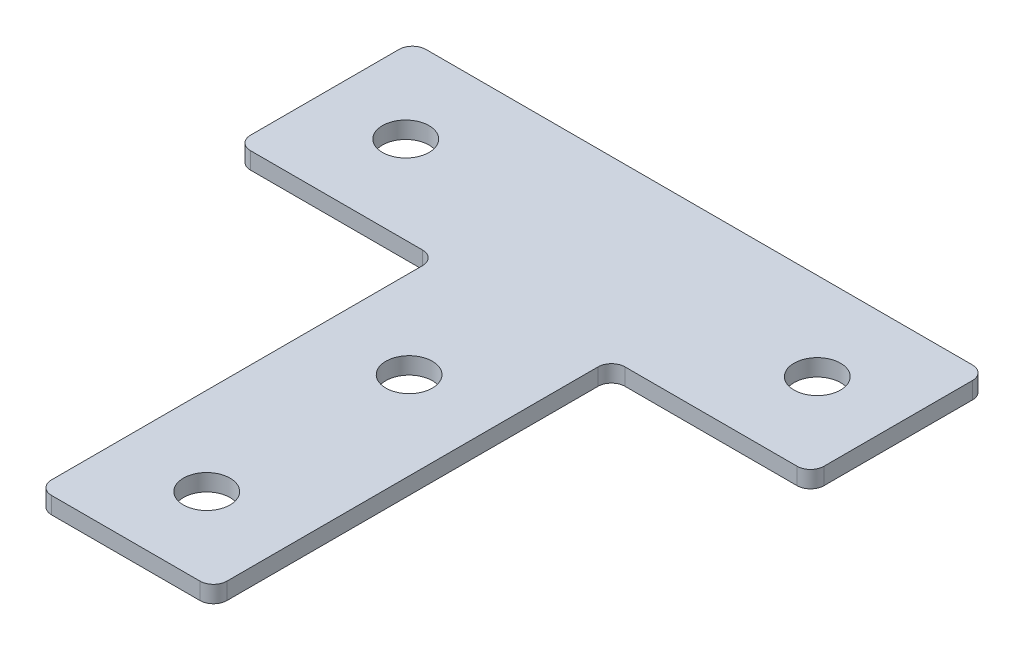
ISO-10303-21;
HEADER;
FILE_DESCRIPTION(('STEP AP214'),'2;1');
FILE_NAME('part.step','',(''),(''),'','','');
FILE_SCHEMA(('AUTOMOTIVE_DESIGN { 1 0 10303 214 1 1 1 1 }'));
ENDSEC;
DATA;
#1=APPLICATION_CONTEXT('core data for automotive mechanical design processes');
#2=APPLICATION_PROTOCOL_DEFINITION('international standard','automotive_design',2000,#1);
#3=PRODUCT_CONTEXT('',#1,'mechanical');
#4=PRODUCT('Part','Part','',(#3));
#5=PRODUCT_RELATED_PRODUCT_CATEGORY('part','',(#4));
#6=PRODUCT_DEFINITION_FORMATION('','',#4);
#7=PRODUCT_DEFINITION_CONTEXT('part definition',#1,'design');
#8=PRODUCT_DEFINITION('design','',#6,#7);
#9=PRODUCT_DEFINITION_SHAPE('','',#8);
#10=(LENGTH_UNIT() NAMED_UNIT(*) SI_UNIT(.MILLI.,.METRE.));
#11=(NAMED_UNIT(*) PLANE_ANGLE_UNIT() SI_UNIT($,.RADIAN.));
#12=(NAMED_UNIT(*) SI_UNIT($,.STERADIAN.) SOLID_ANGLE_UNIT());
#13=UNCERTAINTY_MEASURE_WITH_UNIT(LENGTH_MEASURE(1.E-05),#10,'distance_accuracy_value','');
#14=(GEOMETRIC_REPRESENTATION_CONTEXT(3) GLOBAL_UNCERTAINTY_ASSIGNED_CONTEXT((#13)) GLOBAL_UNIT_ASSIGNED_CONTEXT((#10,
#11,#12)) REPRESENTATION_CONTEXT('',''));
#15=CARTESIAN_POINT('',(0.,0.,0.));
#16=DIRECTION('',(0.,0.,1.));
#17=DIRECTION('',(1.,0.,0.));
#18=AXIS2_PLACEMENT_3D('',#15,#16,#17);
#19=CARTESIAN_POINT('',(0.,2.5,0.));
#20=DIRECTION('',(0.,1.,0.));
#21=DIRECTION('',(0.,0.,1.));
#22=AXIS2_PLACEMENT_3D('',#19,#20,#21);
#23=PLANE('',#22);
#24=CARTESIAN_POINT('',(-30.5,2.5,0.));
#25=DIRECTION('',(0.,1.,0.));
#26=DIRECTION('',(0.,0.,1.));
#27=AXIS2_PLACEMENT_3D('',#24,#25,#26);
#28=CIRCLE('',#27,3.45);
#29=CARTESIAN_POINT('',(-30.5,2.5,3.45));
#30=VERTEX_POINT('',#29);
#31=EDGE_CURVE('E299',#30,#30,#28,.T.);
#32=ORIENTED_EDGE('',*,*,#31,.F.);
#33=EDGE_LOOP('',(#32));
#34=FACE_BOUND('',#33,.T.);
#35=CARTESIAN_POINT('',(0.,2.5,60.));
#36=DIRECTION('',(0.,1.,0.));
#37=DIRECTION('',(0.,0.,1.));
#38=AXIS2_PLACEMENT_3D('',#35,#36,#37);
#39=CIRCLE('',#38,3.45);
#40=CARTESIAN_POINT('',(0.,2.5,63.45));
#41=VERTEX_POINT('',#40);
#42=EDGE_CURVE('E277',#41,#41,#39,.T.);
#43=ORIENTED_EDGE('',*,*,#42,.F.);
#44=EDGE_LOOP('',(#43));
#45=FACE_BOUND('',#44,.T.);
#46=DIRECTION('',(1.,0.,0.));
#47=VECTOR('',#46,1.);
#48=CARTESIAN_POINT('',(-13.,2.5,72.));
#49=LINE('',#48,#47);
#50=CARTESIAN_POINT('',(-11.,2.5,72.));
#51=VERTEX_POINT('',#50);
#52=CARTESIAN_POINT('',(11.,2.5,72.));
#53=VERTEX_POINT('',#52);
#54=EDGE_CURVE('E257',#51,#53,#49,.T.);
#55=ORIENTED_EDGE('',*,*,#54,.T.);
#56=CARTESIAN_POINT('',(11.,2.5,70.));
#57=DIRECTION('',(0.,1.,0.));
#58=DIRECTION('',(0.,0.,1.));
#59=AXIS2_PLACEMENT_3D('',#56,#57,#58);
#60=CIRCLE('',#59,2.);
#61=CARTESIAN_POINT('',(13.,2.5,70.));
#62=VERTEX_POINT('',#61);
#63=EDGE_CURVE('E205',#53,#62,#60,.T.);
#64=ORIENTED_EDGE('',*,*,#63,.T.);
#65=DIRECTION('',(0.,0.,-1.));
#66=VECTOR('',#65,1.);
#67=CARTESIAN_POINT('',(13.,2.5,72.));
#68=LINE('',#67,#66);
#69=CARTESIAN_POINT('',(13.,2.5,15.));
#70=VERTEX_POINT('',#69);
#71=EDGE_CURVE('E166',#62,#70,#68,.T.);
#72=ORIENTED_EDGE('',*,*,#71,.T.);
#73=CARTESIAN_POINT('',(15.,2.5,15.));
#74=DIRECTION('',(0.,1.,0.));
#75=DIRECTION('',(0.,0.,1.));
#76=AXIS2_PLACEMENT_3D('',#73,#74,#75);
#77=CIRCLE('',#76,2.);
#78=CARTESIAN_POINT('',(15.,2.5,13.));
#79=VERTEX_POINT('',#78);
#80=EDGE_CURVE('E11',#70,#79,#77,.F.);
#81=ORIENTED_EDGE('',*,*,#80,.T.);
#82=DIRECTION('',(1.,0.,0.));
#83=VECTOR('',#82,1.);
#84=CARTESIAN_POINT('',(13.,2.5,13.));
#85=LINE('',#84,#83);
#86=CARTESIAN_POINT('',(40.5,2.5,13.));
#87=VERTEX_POINT('',#86);
#88=EDGE_CURVE('E182',#79,#87,#85,.T.);
#89=ORIENTED_EDGE('',*,*,#88,.T.);
#90=CARTESIAN_POINT('',(40.5,2.5,11.));
#91=DIRECTION('',(0.,1.,0.));
#92=DIRECTION('',(0.,0.,1.));
#93=AXIS2_PLACEMENT_3D('',#90,#91,#92);
#94=CIRCLE('',#93,2.);
#95=CARTESIAN_POINT('',(42.5,2.5,11.));
#96=VERTEX_POINT('',#95);
#97=EDGE_CURVE('E199',#87,#96,#94,.T.);
#98=ORIENTED_EDGE('',*,*,#97,.T.);
#99=DIRECTION('',(0.,0.,-1.));
#100=VECTOR('',#99,1.);
#101=CARTESIAN_POINT('',(42.5,2.5,-13.));
#102=LINE('',#101,#100);
#103=CARTESIAN_POINT('',(42.5,2.5,-11.));
#104=VERTEX_POINT('',#103);
#105=EDGE_CURVE('E176',#96,#104,#102,.T.);
#106=ORIENTED_EDGE('',*,*,#105,.T.);
#107=CARTESIAN_POINT('',(40.5,2.5,-11.));
#108=DIRECTION('',(0.,1.,0.));
#109=DIRECTION('',(0.,0.,1.));
#110=AXIS2_PLACEMENT_3D('',#107,#108,#109);
#111=CIRCLE('',#110,2.);
#112=CARTESIAN_POINT('',(40.5,2.5,-13.));
#113=VERTEX_POINT('',#112);
#114=EDGE_CURVE('E197',#104,#113,#111,.T.);
#115=ORIENTED_EDGE('',*,*,#114,.T.);
#116=DIRECTION('',(-1.,0.,0.));
#117=VECTOR('',#116,1.);
#118=CARTESIAN_POINT('',(-42.5,2.5,-13.));
#119=LINE('',#118,#117);
#120=CARTESIAN_POINT('',(-40.5,2.5,-13.));
#121=VERTEX_POINT('',#120);
#122=EDGE_CURVE('E285',#113,#121,#119,.T.);
#123=ORIENTED_EDGE('',*,*,#122,.T.);
#124=CARTESIAN_POINT('',(-40.5,2.5,-11.));
#125=DIRECTION('',(0.,1.,0.));
#126=DIRECTION('',(0.,0.,1.));
#127=AXIS2_PLACEMENT_3D('',#124,#125,#126);
#128=CIRCLE('',#127,2.);
#129=CARTESIAN_POINT('',(-42.5,2.5,-11.));
#130=VERTEX_POINT('',#129);
#131=EDGE_CURVE('E195',#121,#130,#128,.T.);
#132=ORIENTED_EDGE('',*,*,#131,.T.);
#133=DIRECTION('',(0.,0.,1.));
#134=VECTOR('',#133,1.);
#135=CARTESIAN_POINT('',(-42.5,2.5,-13.));
#136=LINE('',#135,#134);
#137=CARTESIAN_POINT('',(-42.5,2.5,11.));
#138=VERTEX_POINT('',#137);
#139=EDGE_CURVE('E282',#130,#138,#136,.T.);
#140=ORIENTED_EDGE('',*,*,#139,.T.);
#141=CARTESIAN_POINT('',(-40.5,2.5,11.));
#142=DIRECTION('',(0.,1.,0.));
#143=DIRECTION('',(0.,0.,1.));
#144=AXIS2_PLACEMENT_3D('',#141,#142,#143);
#145=CIRCLE('',#144,2.);
#146=CARTESIAN_POINT('',(-40.5,2.5,13.));
#147=VERTEX_POINT('',#146);
#148=EDGE_CURVE('E201',#138,#147,#145,.T.);
#149=ORIENTED_EDGE('',*,*,#148,.T.);
#150=DIRECTION('',(1.,0.,0.));
#151=VECTOR('',#150,1.);
#152=CARTESIAN_POINT('',(-42.5,2.5,13.));
#153=LINE('',#152,#151);
#154=CARTESIAN_POINT('',(-15.,2.5,13.));
#155=VERTEX_POINT('',#154);
#156=EDGE_CURVE('E248',#147,#155,#153,.T.);
#157=ORIENTED_EDGE('',*,*,#156,.T.);
#158=CARTESIAN_POINT('',(-15.,2.5,15.));
#159=DIRECTION('',(0.,1.,0.));
#160=DIRECTION('',(0.,0.,1.));
#161=AXIS2_PLACEMENT_3D('',#158,#159,#160);
#162=CIRCLE('',#161,2.);
#163=CARTESIAN_POINT('',(-13.,2.5,15.));
#164=VERTEX_POINT('',#163);
#165=EDGE_CURVE('E238',#155,#164,#162,.F.);
#166=ORIENTED_EDGE('',*,*,#165,.T.);
#167=DIRECTION('',(0.,0.,1.));
#168=VECTOR('',#167,1.);
#169=CARTESIAN_POINT('',(-13.,2.5,72.));
#170=LINE('',#169,#168);
#171=CARTESIAN_POINT('',(-13.,2.5,70.));
#172=VERTEX_POINT('',#171);
#173=EDGE_CURVE('E245',#164,#172,#170,.T.);
#174=ORIENTED_EDGE('',*,*,#173,.T.);
#175=CARTESIAN_POINT('',(-11.,2.5,70.));
#176=DIRECTION('',(0.,1.,0.));
#177=DIRECTION('',(0.,0.,1.));
#178=AXIS2_PLACEMENT_3D('',#175,#176,#177);
#179=CIRCLE('',#178,2.);
#180=EDGE_CURVE('E203',#172,#51,#179,.T.);
#181=ORIENTED_EDGE('',*,*,#180,.T.);
#182=EDGE_LOOP('',(#55,#64,#72,#81,#89,#98,#106,#115,#123,#132,#140,#149,#157,#166,#174,#181));
#183=FACE_BOUND('',#182,.T.);
#184=CARTESIAN_POINT('',(0.,2.5,30.));
#185=DIRECTION('',(0.,1.,0.));
#186=DIRECTION('',(0.,0.,1.));
#187=AXIS2_PLACEMENT_3D('',#184,#185,#186);
#188=CIRCLE('',#187,3.45);
#189=CARTESIAN_POINT('',(0.,2.5,33.45));
#190=VERTEX_POINT('',#189);
#191=EDGE_CURVE('E293',#190,#190,#188,.T.);
#192=ORIENTED_EDGE('',*,*,#191,.F.);
#193=EDGE_LOOP('',(#192));
#194=FACE_BOUND('',#193,.T.);
#195=CARTESIAN_POINT('',(30.5,2.5,0.));
#196=DIRECTION('',(0.,1.,0.));
#197=DIRECTION('',(0.,0.,1.));
#198=AXIS2_PLACEMENT_3D('',#195,#196,#197);
#199=CIRCLE('',#198,3.45000000000001);
#200=CARTESIAN_POINT('',(30.5,2.5,3.45000000000001));
#201=VERTEX_POINT('',#200);
#202=EDGE_CURVE('E305',#201,#201,#199,.T.);
#203=ORIENTED_EDGE('',*,*,#202,.F.);
#204=EDGE_LOOP('',(#203));
#205=FACE_BOUND('',#204,.T.);
#206=ADVANCED_FACE('F34',(#34,#45,#183,#194,#205),#23,.T.);
#207=CARTESIAN_POINT('',(0.,0.,0.));
#208=DIRECTION('',(0.,1.,0.));
#209=DIRECTION('',(0.,0.,1.));
#210=AXIS2_PLACEMENT_3D('',#207,#208,#209);
#211=PLANE('',#210);
#212=DIRECTION('',(0.,0.,-1.));
#213=VECTOR('',#212,1.);
#214=CARTESIAN_POINT('',(13.,0.,72.));
#215=LINE('',#214,#213);
#216=CARTESIAN_POINT('',(13.,0.,70.));
#217=VERTEX_POINT('',#216);
#218=CARTESIAN_POINT('',(13.,0.,15.));
#219=VERTEX_POINT('',#218);
#220=EDGE_CURVE('E164',#217,#219,#215,.T.);
#221=ORIENTED_EDGE('',*,*,#220,.F.);
#222=CARTESIAN_POINT('',(11.,0.,70.));
#223=DIRECTION('',(0.,1.,0.));
#224=DIRECTION('',(0.,0.,1.));
#225=AXIS2_PLACEMENT_3D('',#222,#223,#224);
#226=CIRCLE('',#225,2.);
#227=CARTESIAN_POINT('',(11.,0.,72.));
#228=VERTEX_POINT('',#227);
#229=EDGE_CURVE('E147',#217,#228,#226,.F.);
#230=ORIENTED_EDGE('',*,*,#229,.T.);
#231=DIRECTION('',(1.,0.,0.));
#232=VECTOR('',#231,1.);
#233=CARTESIAN_POINT('',(-13.,0.,72.));
#234=LINE('',#233,#232);
#235=CARTESIAN_POINT('',(-11.,0.,72.));
#236=VERTEX_POINT('',#235);
#237=EDGE_CURVE('E174',#236,#228,#234,.T.);
#238=ORIENTED_EDGE('',*,*,#237,.F.);
#239=CARTESIAN_POINT('',(-11.,0.,70.));
#240=DIRECTION('',(0.,1.,0.));
#241=DIRECTION('',(0.,0.,1.));
#242=AXIS2_PLACEMENT_3D('',#239,#240,#241);
#243=CIRCLE('',#242,2.);
#244=CARTESIAN_POINT('',(-13.,0.,70.));
#245=VERTEX_POINT('',#244);
#246=EDGE_CURVE('E158',#236,#245,#243,.F.);
#247=ORIENTED_EDGE('',*,*,#246,.T.);
#248=DIRECTION('',(0.,0.,1.));
#249=VECTOR('',#248,1.);
#250=CARTESIAN_POINT('',(-13.,0.,72.));
#251=LINE('',#250,#249);
#252=CARTESIAN_POINT('',(-13.,0.,15.));
#253=VERTEX_POINT('',#252);
#254=EDGE_CURVE('E178',#253,#245,#251,.T.);
#255=ORIENTED_EDGE('',*,*,#254,.F.);
#256=CARTESIAN_POINT('',(-15.,0.,15.));
#257=DIRECTION('',(0.,1.,0.));
#258=DIRECTION('',(0.,0.,1.));
#259=AXIS2_PLACEMENT_3D('',#256,#257,#258);
#260=CIRCLE('',#259,2.);
#261=CARTESIAN_POINT('',(-15.,0.,13.));
#262=VERTEX_POINT('',#261);
#263=EDGE_CURVE('E236',#253,#262,#260,.T.);
#264=ORIENTED_EDGE('',*,*,#263,.T.);
#265=DIRECTION('',(1.,0.,0.));
#266=VECTOR('',#265,1.);
#267=CARTESIAN_POINT('',(-42.5,0.,13.));
#268=LINE('',#267,#266);
#269=CARTESIAN_POINT('',(-40.5,0.,13.));
#270=VERTEX_POINT('',#269);
#271=EDGE_CURVE('E262',#270,#262,#268,.T.);
#272=ORIENTED_EDGE('',*,*,#271,.F.);
#273=CARTESIAN_POINT('',(-40.5,0.,11.));
#274=DIRECTION('',(0.,1.,0.));
#275=DIRECTION('',(0.,0.,1.));
#276=AXIS2_PLACEMENT_3D('',#273,#274,#275);
#277=CIRCLE('',#276,2.);
#278=CARTESIAN_POINT('',(-42.5,0.,11.));
#279=VERTEX_POINT('',#278);
#280=EDGE_CURVE('E189',#270,#279,#277,.F.);
#281=ORIENTED_EDGE('',*,*,#280,.T.);
#282=DIRECTION('',(0.,0.,1.));
#283=VECTOR('',#282,1.);
#284=CARTESIAN_POINT('',(-42.5,0.,-13.));
#285=LINE('',#284,#283);
#286=CARTESIAN_POINT('',(-42.5,0.,-11.));
#287=VERTEX_POINT('',#286);
#288=EDGE_CURVE('E266',#287,#279,#285,.T.);
#289=ORIENTED_EDGE('',*,*,#288,.F.);
#290=CARTESIAN_POINT('',(-40.5,0.,-11.));
#291=DIRECTION('',(0.,1.,0.));
#292=DIRECTION('',(0.,0.,1.));
#293=AXIS2_PLACEMENT_3D('',#290,#291,#292);
#294=CIRCLE('',#293,2.);
#295=CARTESIAN_POINT('',(-40.5,0.,-13.));
#296=VERTEX_POINT('',#295);
#297=EDGE_CURVE('E167',#287,#296,#294,.F.);
#298=ORIENTED_EDGE('',*,*,#297,.T.);
#299=DIRECTION('',(-1.,0.,0.));
#300=VECTOR('',#299,1.);
#301=CARTESIAN_POINT('',(-42.5,0.,-13.));
#302=LINE('',#301,#300);
#303=CARTESIAN_POINT('',(40.5,0.,-13.));
#304=VERTEX_POINT('',#303);
#305=EDGE_CURVE('E269',#304,#296,#302,.T.);
#306=ORIENTED_EDGE('',*,*,#305,.F.);
#307=CARTESIAN_POINT('',(40.5,0.,-11.));
#308=DIRECTION('',(0.,1.,0.));
#309=DIRECTION('',(0.,0.,1.));
#310=AXIS2_PLACEMENT_3D('',#307,#308,#309);
#311=CIRCLE('',#310,2.);
#312=CARTESIAN_POINT('',(42.5,0.,-11.));
#313=VERTEX_POINT('',#312);
#314=EDGE_CURVE('E185',#304,#313,#311,.F.);
#315=ORIENTED_EDGE('',*,*,#314,.T.);
#316=DIRECTION('',(0.,0.,-1.));
#317=VECTOR('',#316,1.);
#318=CARTESIAN_POINT('',(42.5,0.,-13.));
#319=LINE('',#318,#317);
#320=CARTESIAN_POINT('',(42.5,0.,11.));
#321=VERTEX_POINT('',#320);
#322=EDGE_CURVE('E274',#321,#313,#319,.T.);
#323=ORIENTED_EDGE('',*,*,#322,.F.);
#324=CARTESIAN_POINT('',(40.5,0.,11.));
#325=DIRECTION('',(0.,1.,0.));
#326=DIRECTION('',(0.,0.,1.));
#327=AXIS2_PLACEMENT_3D('',#324,#325,#326);
#328=CIRCLE('',#327,2.);
#329=CARTESIAN_POINT('',(40.5,0.,13.));
#330=VERTEX_POINT('',#329);
#331=EDGE_CURVE('E187',#321,#330,#328,.F.);
#332=ORIENTED_EDGE('',*,*,#331,.T.);
#333=DIRECTION('',(1.,0.,0.));
#334=VECTOR('',#333,1.);
#335=CARTESIAN_POINT('',(13.,0.,13.));
#336=LINE('',#335,#334);
#337=CARTESIAN_POINT('',(15.,0.,13.));
#338=VERTEX_POINT('',#337);
#339=EDGE_CURVE('E173',#338,#330,#336,.T.);
#340=ORIENTED_EDGE('',*,*,#339,.F.);
#341=CARTESIAN_POINT('',(15.,0.,15.));
#342=DIRECTION('',(0.,1.,0.));
#343=DIRECTION('',(0.,0.,1.));
#344=AXIS2_PLACEMENT_3D('',#341,#342,#343);
#345=CIRCLE('',#344,2.);
#346=EDGE_CURVE('E42',#338,#219,#345,.T.);
#347=ORIENTED_EDGE('',*,*,#346,.T.);
#348=EDGE_LOOP('',(#221,#230,#238,#247,#255,#264,#272,#281,#289,#298,#306,#315,#323,#332,#340,#347));
#349=FACE_BOUND('',#348,.T.);
#350=CARTESIAN_POINT('',(0.,0.,60.));
#351=DIRECTION('',(0.,1.,0.));
#352=DIRECTION('',(0.,0.,1.));
#353=AXIS2_PLACEMENT_3D('',#350,#351,#352);
#354=CIRCLE('',#353,3.45);
#355=CARTESIAN_POINT('',(0.,0.,63.45));
#356=VERTEX_POINT('',#355);
#357=EDGE_CURVE('E290',#356,#356,#354,.T.);
#358=ORIENTED_EDGE('',*,*,#357,.T.);
#359=EDGE_LOOP('',(#358));
#360=FACE_BOUND('',#359,.T.);
#361=CARTESIAN_POINT('',(0.,0.,30.));
#362=DIRECTION('',(0.,1.,0.));
#363=DIRECTION('',(0.,0.,1.));
#364=AXIS2_PLACEMENT_3D('',#361,#362,#363);
#365=CIRCLE('',#364,3.45);
#366=CARTESIAN_POINT('',(0.,0.,33.45));
#367=VERTEX_POINT('',#366);
#368=EDGE_CURVE('E296',#367,#367,#365,.T.);
#369=ORIENTED_EDGE('',*,*,#368,.T.);
#370=EDGE_LOOP('',(#369));
#371=FACE_BOUND('',#370,.T.);
#372=CARTESIAN_POINT('',(-30.5,0.,0.));
#373=DIRECTION('',(0.,1.,0.));
#374=DIRECTION('',(0.,0.,1.));
#375=AXIS2_PLACEMENT_3D('',#372,#373,#374);
#376=CIRCLE('',#375,3.45);
#377=CARTESIAN_POINT('',(-30.5,0.,3.45));
#378=VERTEX_POINT('',#377);
#379=EDGE_CURVE('E302',#378,#378,#376,.T.);
#380=ORIENTED_EDGE('',*,*,#379,.T.);
#381=EDGE_LOOP('',(#380));
#382=FACE_BOUND('',#381,.T.);
#383=CARTESIAN_POINT('',(30.5,0.,0.));
#384=DIRECTION('',(0.,1.,0.));
#385=DIRECTION('',(0.,0.,1.));
#386=AXIS2_PLACEMENT_3D('',#383,#384,#385);
#387=CIRCLE('',#386,3.45000000000001);
#388=CARTESIAN_POINT('',(30.5,0.,3.45000000000001));
#389=VERTEX_POINT('',#388);
#390=EDGE_CURVE('E308',#389,#389,#387,.T.);
#391=ORIENTED_EDGE('',*,*,#390,.T.);
#392=EDGE_LOOP('',(#391));
#393=FACE_BOUND('',#392,.T.);
#394=ADVANCED_FACE('F170',(#349,#360,#371,#382,#393),#211,.F.);
#395=CARTESIAN_POINT('',(42.5,2.5,-13.));
#396=DIRECTION('',(-1.,0.,0.));
#397=DIRECTION('',(0.,0.,1.));
#398=AXIS2_PLACEMENT_3D('',#395,#396,#397);
#399=PLANE('',#398);
#400=ORIENTED_EDGE('',*,*,#105,.F.);
#401=DIRECTION('',(0.,-1.,0.));
#402=VECTOR('',#401,1.);
#403=CARTESIAN_POINT('',(42.5,2.5,11.));
#404=LINE('',#403,#402);
#405=EDGE_CURVE('E228',#96,#321,#404,.T.);
#406=ORIENTED_EDGE('',*,*,#405,.T.);
#407=ORIENTED_EDGE('',*,*,#322,.T.);
#408=DIRECTION('',(0.,-1.,0.));
#409=VECTOR('',#408,1.);
#410=CARTESIAN_POINT('',(42.5,2.5,-11.));
#411=LINE('',#410,#409);
#412=EDGE_CURVE('E226',#313,#104,#411,.F.);
#413=ORIENTED_EDGE('',*,*,#412,.T.);
#414=EDGE_LOOP('',(#400,#406,#407,#413));
#415=FACE_BOUND('',#414,.T.);
#416=ADVANCED_FACE('F323',(#415),#399,.F.);
#417=CARTESIAN_POINT('',(-42.5,2.5,-13.));
#418=DIRECTION('',(0.,0.,1.));
#419=DIRECTION('',(1.,0.,0.));
#420=AXIS2_PLACEMENT_3D('',#417,#418,#419);
#421=PLANE('',#420);
#422=ORIENTED_EDGE('',*,*,#122,.F.);
#423=DIRECTION('',(0.,-1.,0.));
#424=VECTOR('',#423,1.);
#425=CARTESIAN_POINT('',(40.5,2.5,-13.));
#426=LINE('',#425,#424);
#427=EDGE_CURVE('E233',#113,#304,#426,.T.);
#428=ORIENTED_EDGE('',*,*,#427,.T.);
#429=ORIENTED_EDGE('',*,*,#305,.T.);
#430=DIRECTION('',(0.,-1.,0.));
#431=VECTOR('',#430,1.);
#432=CARTESIAN_POINT('',(-40.5,2.5,-13.));
#433=LINE('',#432,#431);
#434=EDGE_CURVE('E231',#296,#121,#433,.F.);
#435=ORIENTED_EDGE('',*,*,#434,.T.);
#436=EDGE_LOOP('',(#422,#428,#429,#435));
#437=FACE_BOUND('',#436,.T.);
#438=ADVANCED_FACE('F347',(#437),#421,.F.);
#439=CARTESIAN_POINT('',(-42.5,2.5,-13.));
#440=DIRECTION('',(1.,0.,0.));
#441=DIRECTION('',(0.,0.,-1.));
#442=AXIS2_PLACEMENT_3D('',#439,#440,#441);
#443=PLANE('',#442);
#444=ORIENTED_EDGE('',*,*,#288,.T.);
#445=DIRECTION('',(0.,-1.,0.));
#446=VECTOR('',#445,1.);
#447=CARTESIAN_POINT('',(-42.5,2.5,11.));
#448=LINE('',#447,#446);
#449=EDGE_CURVE('E220',#279,#138,#448,.F.);
#450=ORIENTED_EDGE('',*,*,#449,.T.);
#451=ORIENTED_EDGE('',*,*,#139,.F.);
#452=DIRECTION('',(0.,-1.,0.));
#453=VECTOR('',#452,1.);
#454=CARTESIAN_POINT('',(-42.5,2.5,-11.));
#455=LINE('',#454,#453);
#456=EDGE_CURVE('E217',#130,#287,#455,.T.);
#457=ORIENTED_EDGE('',*,*,#456,.T.);
#458=EDGE_LOOP('',(#444,#450,#451,#457));
#459=FACE_BOUND('',#458,.T.);
#460=ADVANCED_FACE('F344',(#459),#443,.F.);
#461=CARTESIAN_POINT('',(-42.5,2.5,13.));
#462=DIRECTION('',(0.,0.,-1.));
#463=DIRECTION('',(-1.,0.,0.));
#464=AXIS2_PLACEMENT_3D('',#461,#462,#463);
#465=PLANE('',#464);
#466=ORIENTED_EDGE('',*,*,#271,.T.);
#467=DIRECTION('',(0.,-1.,0.));
#468=VECTOR('',#467,1.);
#469=CARTESIAN_POINT('',(-15.,2.5,13.));
#470=LINE('',#469,#468);
#471=EDGE_CURVE('E215',#262,#155,#470,.F.);
#472=ORIENTED_EDGE('',*,*,#471,.T.);
#473=ORIENTED_EDGE('',*,*,#156,.F.);
#474=DIRECTION('',(0.,-1.,0.));
#475=VECTOR('',#474,1.);
#476=CARTESIAN_POINT('',(-40.5,2.5,13.));
#477=LINE('',#476,#475);
#478=EDGE_CURVE('E212',#147,#270,#477,.T.);
#479=ORIENTED_EDGE('',*,*,#478,.T.);
#480=EDGE_LOOP('',(#466,#472,#473,#479));
#481=FACE_BOUND('',#480,.T.);
#482=ADVANCED_FACE('F264',(#481),#465,.F.);
#483=CARTESIAN_POINT('',(-13.,2.5,72.));
#484=DIRECTION('',(1.,0.,0.));
#485=DIRECTION('',(0.,0.,-1.));
#486=AXIS2_PLACEMENT_3D('',#483,#484,#485);
#487=PLANE('',#486);
#488=ORIENTED_EDGE('',*,*,#254,.T.);
#489=DIRECTION('',(0.,-1.,0.));
#490=VECTOR('',#489,1.);
#491=CARTESIAN_POINT('',(-13.,2.5,70.));
#492=LINE('',#491,#490);
#493=EDGE_CURVE('E210',#245,#172,#492,.F.);
#494=ORIENTED_EDGE('',*,*,#493,.T.);
#495=ORIENTED_EDGE('',*,*,#173,.F.);
#496=DIRECTION('',(0.,-1.,0.));
#497=VECTOR('',#496,1.);
#498=CARTESIAN_POINT('',(-13.,0.,15.));
#499=LINE('',#498,#497);
#500=EDGE_CURVE('E207',#164,#253,#499,.T.);
#501=ORIENTED_EDGE('',*,*,#500,.T.);
#502=EDGE_LOOP('',(#488,#494,#495,#501));
#503=FACE_BOUND('',#502,.T.);
#504=ADVANCED_FACE('F254',(#503),#487,.F.);
#505=CARTESIAN_POINT('',(-13.,2.5,72.));
#506=DIRECTION('',(0.,0.,-1.));
#507=DIRECTION('',(-1.,0.,0.));
#508=AXIS2_PLACEMENT_3D('',#505,#506,#507);
#509=PLANE('',#508);
#510=ORIENTED_EDGE('',*,*,#237,.T.);
#511=DIRECTION('',(0.,-1.,0.));
#512=VECTOR('',#511,1.);
#513=CARTESIAN_POINT('',(11.,2.5,72.));
#514=LINE('',#513,#512);
#515=EDGE_CURVE('E152',#228,#53,#514,.F.);
#516=ORIENTED_EDGE('',*,*,#515,.T.);
#517=ORIENTED_EDGE('',*,*,#54,.F.);
#518=DIRECTION('',(0.,-1.,0.));
#519=VECTOR('',#518,1.);
#520=CARTESIAN_POINT('',(-11.,2.5,72.));
#521=LINE('',#520,#519);
#522=EDGE_CURVE('E157',#51,#236,#521,.T.);
#523=ORIENTED_EDGE('',*,*,#522,.T.);
#524=EDGE_LOOP('',(#510,#516,#517,#523));
#525=FACE_BOUND('',#524,.T.);
#526=ADVANCED_FACE('F336',(#525),#509,.F.);
#527=CARTESIAN_POINT('',(13.,2.5,72.));
#528=DIRECTION('',(-1.,0.,0.));
#529=DIRECTION('',(0.,0.,1.));
#530=AXIS2_PLACEMENT_3D('',#527,#528,#529);
#531=PLANE('',#530);
#532=ORIENTED_EDGE('',*,*,#71,.F.);
#533=DIRECTION('',(0.,-1.,0.));
#534=VECTOR('',#533,1.);
#535=CARTESIAN_POINT('',(13.,2.5,70.));
#536=LINE('',#535,#534);
#537=EDGE_CURVE('E151',#62,#217,#536,.T.);
#538=ORIENTED_EDGE('',*,*,#537,.T.);
#539=ORIENTED_EDGE('',*,*,#220,.T.);
#540=DIRECTION('',(0.,-1.,0.));
#541=VECTOR('',#540,1.);
#542=CARTESIAN_POINT('',(13.,2.5,15.));
#543=LINE('',#542,#541);
#544=EDGE_CURVE('E168',#219,#70,#543,.F.);
#545=ORIENTED_EDGE('',*,*,#544,.T.);
#546=EDGE_LOOP('',(#532,#538,#539,#545));
#547=FACE_BOUND('',#546,.T.);
#548=ADVANCED_FACE('F163',(#547),#531,.F.);
#549=CARTESIAN_POINT('',(13.,2.5,13.));
#550=DIRECTION('',(0.,0.,-1.));
#551=DIRECTION('',(-1.,0.,0.));
#552=AXIS2_PLACEMENT_3D('',#549,#550,#551);
#553=PLANE('',#552);
#554=ORIENTED_EDGE('',*,*,#88,.F.);
#555=DIRECTION('',(0.,-1.,0.));
#556=VECTOR('',#555,1.);
#557=CARTESIAN_POINT('',(15.,0.,13.));
#558=LINE('',#557,#556);
#559=EDGE_CURVE('E223',#79,#338,#558,.T.);
#560=ORIENTED_EDGE('',*,*,#559,.T.);
#561=ORIENTED_EDGE('',*,*,#339,.T.);
#562=DIRECTION('',(0.,-1.,0.));
#563=VECTOR('',#562,1.);
#564=CARTESIAN_POINT('',(40.5,2.5,13.));
#565=LINE('',#564,#563);
#566=EDGE_CURVE('E49',#330,#87,#565,.F.);
#567=ORIENTED_EDGE('',*,*,#566,.T.);
#568=EDGE_LOOP('',(#554,#560,#561,#567));
#569=FACE_BOUND('',#568,.T.);
#570=ADVANCED_FACE('F331',(#569),#553,.F.);
#571=CARTESIAN_POINT('',(0.,2.5,60.));
#572=DIRECTION('',(0.,-1.,0.));
#573=DIRECTION('',(0.,0.,-1.));
#574=AXIS2_PLACEMENT_3D('',#571,#572,#573);
#575=CYLINDRICAL_SURFACE('',#574,3.45);
#576=ORIENTED_EDGE('',*,*,#42,.T.);
#577=EDGE_LOOP('',(#576));
#578=FACE_BOUND('',#577,.T.);
#579=ORIENTED_EDGE('',*,*,#357,.F.);
#580=EDGE_LOOP('',(#579));
#581=FACE_BOUND('',#580,.T.);
#582=ADVANCED_FACE('F328',(#578,#581),#575,.F.);
#583=CARTESIAN_POINT('',(0.,2.5,30.));
#584=DIRECTION('',(0.,-1.,0.));
#585=DIRECTION('',(0.,0.,-1.));
#586=AXIS2_PLACEMENT_3D('',#583,#584,#585);
#587=CYLINDRICAL_SURFACE('',#586,3.45);
#588=ORIENTED_EDGE('',*,*,#191,.T.);
#589=EDGE_LOOP('',(#588));
#590=FACE_BOUND('',#589,.T.);
#591=ORIENTED_EDGE('',*,*,#368,.F.);
#592=EDGE_LOOP('',(#591));
#593=FACE_BOUND('',#592,.T.);
#594=ADVANCED_FACE('F520',(#590,#593),#587,.F.);
#595=CARTESIAN_POINT('',(-30.5,2.5,0.));
#596=DIRECTION('',(0.,-1.,0.));
#597=DIRECTION('',(0.,0.,-1.));
#598=AXIS2_PLACEMENT_3D('',#595,#596,#597);
#599=CYLINDRICAL_SURFACE('',#598,3.45);
#600=ORIENTED_EDGE('',*,*,#31,.T.);
#601=EDGE_LOOP('',(#600));
#602=FACE_BOUND('',#601,.T.);
#603=ORIENTED_EDGE('',*,*,#379,.F.);
#604=EDGE_LOOP('',(#603));
#605=FACE_BOUND('',#604,.T.);
#606=ADVANCED_FACE('F511',(#602,#605),#599,.F.);
#607=CARTESIAN_POINT('',(30.5,2.5,0.));
#608=DIRECTION('',(0.,-1.,0.));
#609=DIRECTION('',(0.,0.,-1.));
#610=AXIS2_PLACEMENT_3D('',#607,#608,#609);
#611=CYLINDRICAL_SURFACE('',#610,3.45000000000001);
#612=ORIENTED_EDGE('',*,*,#202,.T.);
#613=EDGE_LOOP('',(#612));
#614=FACE_BOUND('',#613,.T.);
#615=ORIENTED_EDGE('',*,*,#390,.F.);
#616=EDGE_LOOP('',(#615));
#617=FACE_BOUND('',#616,.T.);
#618=ADVANCED_FACE('F314',(#614,#617),#611,.F.);
#619=CARTESIAN_POINT('',(11.,2.5,70.));
#620=DIRECTION('',(0.,-1.,0.));
#621=DIRECTION('',(0.,0.,-1.));
#622=AXIS2_PLACEMENT_3D('',#619,#620,#621);
#623=CYLINDRICAL_SURFACE('',#622,2.);
#624=ORIENTED_EDGE('',*,*,#63,.F.);
#625=ORIENTED_EDGE('',*,*,#515,.F.);
#626=ORIENTED_EDGE('',*,*,#229,.F.);
#627=ORIENTED_EDGE('',*,*,#537,.F.);
#628=EDGE_LOOP('',(#624,#625,#626,#627));
#629=FACE_BOUND('',#628,.T.);
#630=ADVANCED_FACE('F150',(#629),#623,.T.);
#631=CARTESIAN_POINT('',(-11.,2.5,70.));
#632=DIRECTION('',(0.,-1.,0.));
#633=DIRECTION('',(0.,0.,-1.));
#634=AXIS2_PLACEMENT_3D('',#631,#632,#633);
#635=CYLINDRICAL_SURFACE('',#634,2.);
#636=ORIENTED_EDGE('',*,*,#180,.F.);
#637=ORIENTED_EDGE('',*,*,#493,.F.);
#638=ORIENTED_EDGE('',*,*,#246,.F.);
#639=ORIENTED_EDGE('',*,*,#522,.F.);
#640=EDGE_LOOP('',(#636,#637,#638,#639));
#641=FACE_BOUND('',#640,.T.);
#642=ADVANCED_FACE('F357',(#641),#635,.T.);
#643=CARTESIAN_POINT('',(-15.,2.5,15.));
#644=DIRECTION('',(0.,1.,0.));
#645=DIRECTION('',(0.,0.,1.));
#646=AXIS2_PLACEMENT_3D('',#643,#644,#645);
#647=CYLINDRICAL_SURFACE('',#646,2.);
#648=ORIENTED_EDGE('',*,*,#165,.F.);
#649=ORIENTED_EDGE('',*,*,#471,.F.);
#650=ORIENTED_EDGE('',*,*,#263,.F.);
#651=ORIENTED_EDGE('',*,*,#500,.F.);
#652=EDGE_LOOP('',(#648,#649,#650,#651));
#653=FACE_BOUND('',#652,.T.);
#654=ADVANCED_FACE('F259',(#653),#647,.F.);
#655=CARTESIAN_POINT('',(-40.5,2.5,11.));
#656=DIRECTION('',(0.,-1.,0.));
#657=DIRECTION('',(0.,0.,-1.));
#658=AXIS2_PLACEMENT_3D('',#655,#656,#657);
#659=CYLINDRICAL_SURFACE('',#658,2.);
#660=ORIENTED_EDGE('',*,*,#148,.F.);
#661=ORIENTED_EDGE('',*,*,#449,.F.);
#662=ORIENTED_EDGE('',*,*,#280,.F.);
#663=ORIENTED_EDGE('',*,*,#478,.F.);
#664=EDGE_LOOP('',(#660,#661,#662,#663));
#665=FACE_BOUND('',#664,.T.);
#666=ADVANCED_FACE('F363',(#665),#659,.T.);
#667=CARTESIAN_POINT('',(15.,2.5,15.));
#668=DIRECTION('',(0.,1.,0.));
#669=DIRECTION('',(0.,0.,1.));
#670=AXIS2_PLACEMENT_3D('',#667,#668,#669);
#671=CYLINDRICAL_SURFACE('',#670,2.);
#672=ORIENTED_EDGE('',*,*,#80,.F.);
#673=ORIENTED_EDGE('',*,*,#544,.F.);
#674=ORIENTED_EDGE('',*,*,#346,.F.);
#675=ORIENTED_EDGE('',*,*,#559,.F.);
#676=EDGE_LOOP('',(#672,#673,#674,#675));
#677=FACE_BOUND('',#676,.T.);
#678=ADVANCED_FACE('F366',(#677),#671,.F.);
#679=CARTESIAN_POINT('',(40.5,2.5,11.));
#680=DIRECTION('',(0.,-1.,0.));
#681=DIRECTION('',(0.,0.,-1.));
#682=AXIS2_PLACEMENT_3D('',#679,#680,#681);
#683=CYLINDRICAL_SURFACE('',#682,2.);
#684=ORIENTED_EDGE('',*,*,#97,.F.);
#685=ORIENTED_EDGE('',*,*,#566,.F.);
#686=ORIENTED_EDGE('',*,*,#331,.F.);
#687=ORIENTED_EDGE('',*,*,#405,.F.);
#688=EDGE_LOOP('',(#684,#685,#686,#687));
#689=FACE_BOUND('',#688,.T.);
#690=ADVANCED_FACE('F370',(#689),#683,.T.);
#691=CARTESIAN_POINT('',(40.5,2.5,-11.));
#692=DIRECTION('',(0.,-1.,0.));
#693=DIRECTION('',(0.,0.,-1.));
#694=AXIS2_PLACEMENT_3D('',#691,#692,#693);
#695=CYLINDRICAL_SURFACE('',#694,2.);
#696=ORIENTED_EDGE('',*,*,#114,.F.);
#697=ORIENTED_EDGE('',*,*,#412,.F.);
#698=ORIENTED_EDGE('',*,*,#314,.F.);
#699=ORIENTED_EDGE('',*,*,#427,.F.);
#700=EDGE_LOOP('',(#696,#697,#698,#699));
#701=FACE_BOUND('',#700,.T.);
#702=ADVANCED_FACE('F373',(#701),#695,.T.);
#703=CARTESIAN_POINT('',(-40.5,2.5,-11.));
#704=DIRECTION('',(0.,-1.,0.));
#705=DIRECTION('',(0.,0.,-1.));
#706=AXIS2_PLACEMENT_3D('',#703,#704,#705);
#707=CYLINDRICAL_SURFACE('',#706,2.);
#708=ORIENTED_EDGE('',*,*,#131,.F.);
#709=ORIENTED_EDGE('',*,*,#434,.F.);
#710=ORIENTED_EDGE('',*,*,#297,.F.);
#711=ORIENTED_EDGE('',*,*,#456,.F.);
#712=EDGE_LOOP('',(#708,#709,#710,#711));
#713=FACE_BOUND('',#712,.T.);
#714=ADVANCED_FACE('F36',(#713),#707,.T.);
#715=CLOSED_SHELL('',(#206,#394,#416,#438,#460,#482,#504,#526,#548,#570,#582,#594,#606,#618,
#630,#642,#654,#666,#678,#690,#702,#714));
#716=MANIFOLD_SOLID_BREP('B2',#715);
#717=ADVANCED_BREP_SHAPE_REPRESENTATION('',(#18,#716),#14);
#718=SHAPE_DEFINITION_REPRESENTATION(#9,#717);
ENDSEC;
END-ISO-10303-21;
